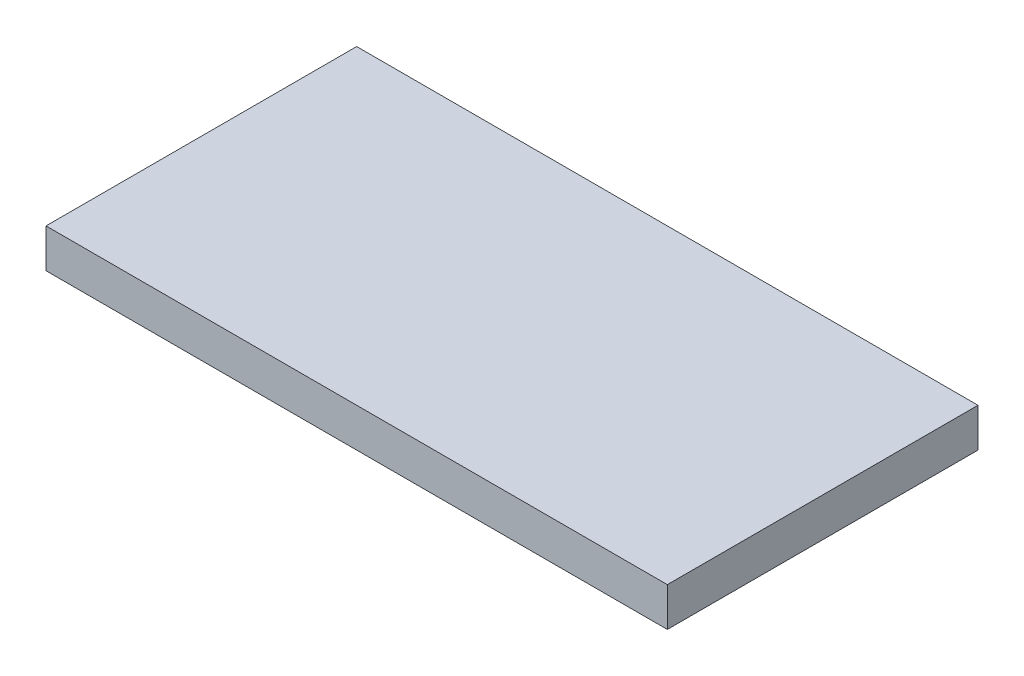
ISO-10303-21;
HEADER;
FILE_DESCRIPTION(('STEP AP214'),'2;1');
FILE_NAME('part.step','',(''),(''),'','','');
FILE_SCHEMA(('AUTOMOTIVE_DESIGN { 1 0 10303 214 1 1 1 1 }'));
ENDSEC;
DATA;
#1=APPLICATION_CONTEXT('core data for automotive mechanical design processes');
#2=APPLICATION_PROTOCOL_DEFINITION('international standard','automotive_design',2000,#1);
#3=PRODUCT_CONTEXT('',#1,'mechanical');
#4=PRODUCT('Part','Part','',(#3));
#5=PRODUCT_RELATED_PRODUCT_CATEGORY('part','',(#4));
#6=PRODUCT_DEFINITION_FORMATION('','',#4);
#7=PRODUCT_DEFINITION_CONTEXT('part definition',#1,'design');
#8=PRODUCT_DEFINITION('design','',#6,#7);
#9=PRODUCT_DEFINITION_SHAPE('','',#8);
#10=(LENGTH_UNIT() NAMED_UNIT(*) SI_UNIT(.MILLI.,.METRE.));
#11=(NAMED_UNIT(*) PLANE_ANGLE_UNIT() SI_UNIT($,.RADIAN.));
#12=(NAMED_UNIT(*) SI_UNIT($,.STERADIAN.) SOLID_ANGLE_UNIT());
#13=UNCERTAINTY_MEASURE_WITH_UNIT(LENGTH_MEASURE(1.E-05),#10,'distance_accuracy_value','');
#14=(GEOMETRIC_REPRESENTATION_CONTEXT(3) GLOBAL_UNCERTAINTY_ASSIGNED_CONTEXT((#13)) GLOBAL_UNIT_ASSIGNED_CONTEXT((#10,
#11,#12)) REPRESENTATION_CONTEXT('',''));
#15=CARTESIAN_POINT('',(0.,0.,0.));
#16=DIRECTION('',(0.,0.,1.));
#17=DIRECTION('',(1.,0.,0.));
#18=AXIS2_PLACEMENT_3D('',#15,#16,#17);
#19=CARTESIAN_POINT('',(-101.6,6.35,-50.8));
#20=DIRECTION('',(1.,0.,0.));
#21=DIRECTION('',(0.,0.,-1.));
#22=AXIS2_PLACEMENT_3D('',#19,#20,#21);
#23=PLANE('',#22);
#24=DIRECTION('',(0.,0.,1.));
#25=VECTOR('',#24,1.);
#26=CARTESIAN_POINT('',(-101.6,-6.35,-50.8));
#27=LINE('',#26,#25);
#28=CARTESIAN_POINT('',(-101.6,-6.35,-50.8));
#29=VERTEX_POINT('',#28);
#30=CARTESIAN_POINT('',(-101.6,-6.35,50.8));
#31=VERTEX_POINT('',#30);
#32=EDGE_CURVE('E96',#29,#31,#27,.T.);
#33=ORIENTED_EDGE('',*,*,#32,.T.);
#34=DIRECTION('',(0.,-1.,0.));
#35=VECTOR('',#34,1.);
#36=CARTESIAN_POINT('',(-101.6,6.35,50.8));
#37=LINE('',#36,#35);
#38=CARTESIAN_POINT('',(-101.6,6.35,50.8));
#39=VERTEX_POINT('',#38);
#40=EDGE_CURVE('E11',#39,#31,#37,.T.);
#41=ORIENTED_EDGE('',*,*,#40,.F.);
#42=DIRECTION('',(0.,0.,1.));
#43=VECTOR('',#42,1.);
#44=CARTESIAN_POINT('',(-101.6,6.35,-50.8));
#45=LINE('',#44,#43);
#46=CARTESIAN_POINT('',(-101.6,6.35,-50.8));
#47=VERTEX_POINT('',#46);
#48=EDGE_CURVE('E84',#47,#39,#45,.T.);
#49=ORIENTED_EDGE('',*,*,#48,.F.);
#50=DIRECTION('',(0.,-1.,0.));
#51=VECTOR('',#50,1.);
#52=CARTESIAN_POINT('',(-101.6,6.35,-50.8));
#53=LINE('',#52,#51);
#54=EDGE_CURVE('E92',#47,#29,#53,.T.);
#55=ORIENTED_EDGE('',*,*,#54,.T.);
#56=EDGE_LOOP('',(#33,#41,#49,#55));
#57=FACE_BOUND('',#56,.T.);
#58=ADVANCED_FACE('F33',(#57),#23,.F.);
#59=CARTESIAN_POINT('',(-101.6,6.35,50.8));
#60=DIRECTION('',(0.,0.,-1.));
#61=DIRECTION('',(-1.,0.,0.));
#62=AXIS2_PLACEMENT_3D('',#59,#60,#61);
#63=PLANE('',#62);
#64=DIRECTION('',(1.,0.,0.));
#65=VECTOR('',#64,1.);
#66=CARTESIAN_POINT('',(-101.6,-6.35,50.8));
#67=LINE('',#66,#65);
#68=CARTESIAN_POINT('',(101.6,-6.35,50.8));
#69=VERTEX_POINT('',#68);
#70=EDGE_CURVE('E88',#31,#69,#67,.T.);
#71=ORIENTED_EDGE('',*,*,#70,.T.);
#72=DIRECTION('',(0.,-1.,0.));
#73=VECTOR('',#72,1.);
#74=CARTESIAN_POINT('',(101.6,6.35,50.8));
#75=LINE('',#74,#73);
#76=CARTESIAN_POINT('',(101.6,6.35,50.8));
#77=VERTEX_POINT('',#76);
#78=EDGE_CURVE('E41',#77,#69,#75,.T.);
#79=ORIENTED_EDGE('',*,*,#78,.F.);
#80=DIRECTION('',(1.,0.,0.));
#81=VECTOR('',#80,1.);
#82=CARTESIAN_POINT('',(-101.6,6.35,50.8));
#83=LINE('',#82,#81);
#84=EDGE_CURVE('E79',#39,#77,#83,.T.);
#85=ORIENTED_EDGE('',*,*,#84,.F.);
#86=ORIENTED_EDGE('',*,*,#40,.T.);
#87=EDGE_LOOP('',(#71,#79,#85,#86));
#88=FACE_BOUND('',#87,.T.);
#89=ADVANCED_FACE('F87',(#88),#63,.F.);
#90=CARTESIAN_POINT('',(101.6,6.35,-50.8));
#91=DIRECTION('',(-1.,0.,0.));
#92=DIRECTION('',(0.,0.,1.));
#93=AXIS2_PLACEMENT_3D('',#90,#91,#92);
#94=PLANE('',#93);
#95=DIRECTION('',(0.,0.,-1.));
#96=VECTOR('',#95,1.);
#97=CARTESIAN_POINT('',(101.6,-6.35,-50.8));
#98=LINE('',#97,#96);
#99=CARTESIAN_POINT('',(101.6,-6.35,-50.8));
#100=VERTEX_POINT('',#99);
#101=EDGE_CURVE('E66',#69,#100,#98,.T.);
#102=ORIENTED_EDGE('',*,*,#101,.T.);
#103=DIRECTION('',(0.,-1.,0.));
#104=VECTOR('',#103,1.);
#105=CARTESIAN_POINT('',(101.6,6.35,-50.8));
#106=LINE('',#105,#104);
#107=CARTESIAN_POINT('',(101.6,6.35,-50.8));
#108=VERTEX_POINT('',#107);
#109=EDGE_CURVE('E89',#108,#100,#106,.T.);
#110=ORIENTED_EDGE('',*,*,#109,.F.);
#111=DIRECTION('',(0.,0.,-1.));
#112=VECTOR('',#111,1.);
#113=CARTESIAN_POINT('',(101.6,6.35,-50.8));
#114=LINE('',#113,#112);
#115=EDGE_CURVE('E82',#77,#108,#114,.T.);
#116=ORIENTED_EDGE('',*,*,#115,.F.);
#117=ORIENTED_EDGE('',*,*,#78,.T.);
#118=EDGE_LOOP('',(#102,#110,#116,#117));
#119=FACE_BOUND('',#118,.T.);
#120=ADVANCED_FACE('F90',(#119),#94,.F.);
#121=CARTESIAN_POINT('',(-101.6,6.35,-50.8));
#122=DIRECTION('',(0.,0.,1.));
#123=DIRECTION('',(1.,0.,0.));
#124=AXIS2_PLACEMENT_3D('',#121,#122,#123);
#125=PLANE('',#124);
#126=DIRECTION('',(-1.,0.,0.));
#127=VECTOR('',#126,1.);
#128=CARTESIAN_POINT('',(-101.6,-6.35,-50.8));
#129=LINE('',#128,#127);
#130=EDGE_CURVE('E72',#100,#29,#129,.T.);
#131=ORIENTED_EDGE('',*,*,#130,.T.);
#132=ORIENTED_EDGE('',*,*,#54,.F.);
#133=DIRECTION('',(-1.,0.,0.));
#134=VECTOR('',#133,1.);
#135=CARTESIAN_POINT('',(-101.6,6.35,-50.8));
#136=LINE('',#135,#134);
#137=EDGE_CURVE('E49',#108,#47,#136,.T.);
#138=ORIENTED_EDGE('',*,*,#137,.F.);
#139=ORIENTED_EDGE('',*,*,#109,.T.);
#140=EDGE_LOOP('',(#131,#132,#138,#139));
#141=FACE_BOUND('',#140,.T.);
#142=ADVANCED_FACE('F103',(#141),#125,.F.);
#143=CARTESIAN_POINT('',(0.,6.35,0.));
#144=DIRECTION('',(0.,1.,0.));
#145=DIRECTION('',(0.,0.,1.));
#146=AXIS2_PLACEMENT_3D('',#143,#144,#145);
#147=PLANE('',#146);
#148=ORIENTED_EDGE('',*,*,#48,.T.);
#149=ORIENTED_EDGE('',*,*,#84,.T.);
#150=ORIENTED_EDGE('',*,*,#115,.T.);
#151=ORIENTED_EDGE('',*,*,#137,.T.);
#152=EDGE_LOOP('',(#148,#149,#150,#151));
#153=FACE_BOUND('',#152,.T.);
#154=ADVANCED_FACE('F80',(#153),#147,.T.);
#155=CARTESIAN_POINT('',(0.,-6.35,0.));
#156=DIRECTION('',(0.,1.,0.));
#157=DIRECTION('',(0.,0.,1.));
#158=AXIS2_PLACEMENT_3D('',#155,#156,#157);
#159=PLANE('',#158);
#160=ORIENTED_EDGE('',*,*,#32,.F.);
#161=ORIENTED_EDGE('',*,*,#130,.F.);
#162=ORIENTED_EDGE('',*,*,#101,.F.);
#163=ORIENTED_EDGE('',*,*,#70,.F.);
#164=EDGE_LOOP('',(#160,#161,#162,#163));
#165=FACE_BOUND('',#164,.T.);
#166=ADVANCED_FACE('F106',(#165),#159,.F.);
#167=CLOSED_SHELL('',(#58,#89,#120,#142,#154,#166));
#168=MANIFOLD_SOLID_BREP('B2',#167);
#169=ADVANCED_BREP_SHAPE_REPRESENTATION('',(#18,#168),#14);
#170=SHAPE_DEFINITION_REPRESENTATION(#9,#169);
ENDSEC;
END-ISO-10303-21;
